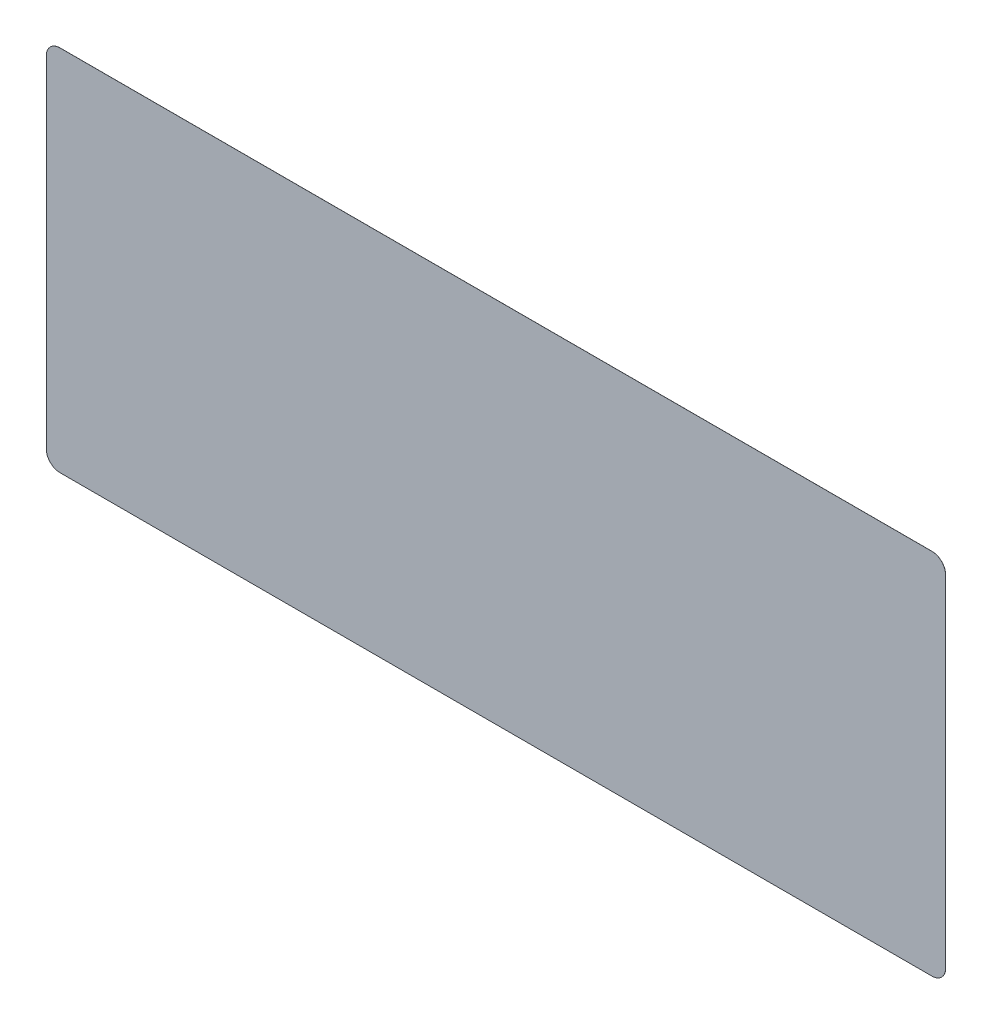
ISO-10303-21;
HEADER;
FILE_DESCRIPTION(('STEP AP214'),'2;1');
FILE_NAME('part.step','',(''),(''),'','','');
FILE_SCHEMA(('AUTOMOTIVE_DESIGN { 1 0 10303 214 1 1 1 1 }'));
ENDSEC;
DATA;
#1=APPLICATION_CONTEXT('core data for automotive mechanical design processes');
#2=APPLICATION_PROTOCOL_DEFINITION('international standard','automotive_design',2000,#1);
#3=PRODUCT_CONTEXT('',#1,'mechanical');
#4=PRODUCT('Part','Part','',(#3));
#5=PRODUCT_RELATED_PRODUCT_CATEGORY('part','',(#4));
#6=PRODUCT_DEFINITION_FORMATION('','',#4);
#7=PRODUCT_DEFINITION_CONTEXT('part definition',#1,'design');
#8=PRODUCT_DEFINITION('design','',#6,#7);
#9=PRODUCT_DEFINITION_SHAPE('','',#8);
#10=(LENGTH_UNIT() NAMED_UNIT(*) SI_UNIT(.MILLI.,.METRE.));
#11=(NAMED_UNIT(*) PLANE_ANGLE_UNIT() SI_UNIT($,.RADIAN.));
#12=(NAMED_UNIT(*) SI_UNIT($,.STERADIAN.) SOLID_ANGLE_UNIT());
#13=UNCERTAINTY_MEASURE_WITH_UNIT(LENGTH_MEASURE(1.E-05),#10,'distance_accuracy_value','');
#14=(GEOMETRIC_REPRESENTATION_CONTEXT(3) GLOBAL_UNCERTAINTY_ASSIGNED_CONTEXT((#13)) GLOBAL_UNIT_ASSIGNED_CONTEXT((#10,
#11,#12)) REPRESENTATION_CONTEXT('',''));
#15=CARTESIAN_POINT('',(0.,0.,0.));
#16=DIRECTION('',(0.,0.,1.));
#17=DIRECTION('',(1.,0.,0.));
#18=AXIS2_PLACEMENT_3D('',#15,#16,#17);
#19=CARTESIAN_POINT('',(78.,85.,0.01));
#20=DIRECTION('',(0.,0.,-1.));
#21=DIRECTION('',(-1.,0.,0.));
#22=AXIS2_PLACEMENT_3D('',#19,#20,#21);
#23=CYLINDRICAL_SURFACE('',#22,2.);
#24=CARTESIAN_POINT('',(78.,85.,0.));
#25=DIRECTION('',(0.,0.,1.));
#26=DIRECTION('',(1.,0.,0.));
#27=AXIS2_PLACEMENT_3D('',#24,#25,#26);
#28=CIRCLE('',#27,2.);
#29=CARTESIAN_POINT('',(76.,85.,0.));
#30=VERTEX_POINT('',#29);
#31=CARTESIAN_POINT('',(78.,83.,0.));
#32=VERTEX_POINT('',#31);
#33=EDGE_CURVE('E142',#30,#32,#28,.T.);
#34=ORIENTED_EDGE('',*,*,#33,.T.);
#35=DIRECTION('',(0.,0.,-1.));
#36=VECTOR('',#35,1.);
#37=CARTESIAN_POINT('',(78.,83.,0.01));
#38=LINE('',#37,#36);
#39=CARTESIAN_POINT('',(78.,83.,0.01));
#40=VERTEX_POINT('',#39);
#41=EDGE_CURVE('E11',#40,#32,#38,.T.);
#42=ORIENTED_EDGE('',*,*,#41,.F.);
#43=CARTESIAN_POINT('',(78.,85.,0.01));
#44=DIRECTION('',(0.,0.,1.));
#45=DIRECTION('',(1.,0.,0.));
#46=AXIS2_PLACEMENT_3D('',#43,#44,#45);
#47=CIRCLE('',#46,2.);
#48=CARTESIAN_POINT('',(76.,85.,0.01));
#49=VERTEX_POINT('',#48);
#50=EDGE_CURVE('E164',#49,#40,#47,.T.);
#51=ORIENTED_EDGE('',*,*,#50,.F.);
#52=DIRECTION('',(0.,0.,-1.));
#53=VECTOR('',#52,1.);
#54=CARTESIAN_POINT('',(76.,85.,0.01));
#55=LINE('',#54,#53);
#56=EDGE_CURVE('E138',#49,#30,#55,.T.);
#57=ORIENTED_EDGE('',*,*,#56,.T.);
#58=EDGE_LOOP('',(#34,#42,#51,#57));
#59=FACE_BOUND('',#58,.T.);
#60=ADVANCED_FACE('F41',(#59),#23,.T.);
#61=CARTESIAN_POINT('',(78.,83.,0.01));
#62=DIRECTION('',(0.,1.,0.));
#63=DIRECTION('',(0.,0.,1.));
#64=AXIS2_PLACEMENT_3D('',#61,#62,#63);
#65=PLANE('',#64);
#66=DIRECTION('',(1.,0.,0.));
#67=VECTOR('',#66,1.);
#68=CARTESIAN_POINT('',(78.,83.,0.));
#69=LINE('',#68,#67);
#70=CARTESIAN_POINT('',(206.,83.,0.));
#71=VERTEX_POINT('',#70);
#72=EDGE_CURVE('E146',#32,#71,#69,.T.);
#73=ORIENTED_EDGE('',*,*,#72,.T.);
#74=DIRECTION('',(0.,0.,-1.));
#75=VECTOR('',#74,1.);
#76=CARTESIAN_POINT('',(206.,83.,0.01));
#77=LINE('',#76,#75);
#78=CARTESIAN_POINT('',(206.,83.,0.01));
#79=VERTEX_POINT('',#78);
#80=EDGE_CURVE('E50',#79,#71,#77,.T.);
#81=ORIENTED_EDGE('',*,*,#80,.F.);
#82=DIRECTION('',(1.,0.,0.));
#83=VECTOR('',#82,1.);
#84=CARTESIAN_POINT('',(78.,83.,0.01));
#85=LINE('',#84,#83);
#86=EDGE_CURVE('E101',#40,#79,#85,.T.);
#87=ORIENTED_EDGE('',*,*,#86,.F.);
#88=ORIENTED_EDGE('',*,*,#41,.T.);
#89=EDGE_LOOP('',(#73,#81,#87,#88));
#90=FACE_BOUND('',#89,.T.);
#91=ADVANCED_FACE('F210',(#90),#65,.F.);
#92=CARTESIAN_POINT('',(206.,85.,0.01));
#93=DIRECTION('',(0.,0.,-1.));
#94=DIRECTION('',(-1.,0.,0.));
#95=AXIS2_PLACEMENT_3D('',#92,#93,#94);
#96=CYLINDRICAL_SURFACE('',#95,2.);
#97=CARTESIAN_POINT('',(206.,85.,0.));
#98=DIRECTION('',(0.,0.,1.));
#99=DIRECTION('',(1.,0.,0.));
#100=AXIS2_PLACEMENT_3D('',#97,#98,#99);
#101=CIRCLE('',#100,2.);
#102=CARTESIAN_POINT('',(208.,85.,0.));
#103=VERTEX_POINT('',#102);
#104=EDGE_CURVE('E149',#71,#103,#101,.T.);
#105=ORIENTED_EDGE('',*,*,#104,.T.);
#106=DIRECTION('',(0.,0.,-1.));
#107=VECTOR('',#106,1.);
#108=CARTESIAN_POINT('',(208.,85.,0.01));
#109=LINE('',#108,#107);
#110=CARTESIAN_POINT('',(208.,85.,0.01));
#111=VERTEX_POINT('',#110);
#112=EDGE_CURVE('E175',#111,#103,#109,.T.);
#113=ORIENTED_EDGE('',*,*,#112,.F.);
#114=CARTESIAN_POINT('',(206.,85.,0.01));
#115=DIRECTION('',(0.,0.,1.));
#116=DIRECTION('',(1.,0.,0.));
#117=AXIS2_PLACEMENT_3D('',#114,#115,#116);
#118=CIRCLE('',#117,2.);
#119=EDGE_CURVE('E185',#79,#111,#118,.T.);
#120=ORIENTED_EDGE('',*,*,#119,.F.);
#121=ORIENTED_EDGE('',*,*,#80,.T.);
#122=EDGE_LOOP('',(#105,#113,#120,#121));
#123=FACE_BOUND('',#122,.T.);
#124=ADVANCED_FACE('F183',(#123),#96,.T.);
#125=CARTESIAN_POINT('',(208.,135.,0.01));
#126=DIRECTION('',(-1.,0.,0.));
#127=DIRECTION('',(0.,0.,1.));
#128=AXIS2_PLACEMENT_3D('',#125,#126,#127);
#129=PLANE('',#128);
#130=DIRECTION('',(0.,1.,0.));
#131=VECTOR('',#130,1.);
#132=CARTESIAN_POINT('',(208.,135.,0.));
#133=LINE('',#132,#131);
#134=CARTESIAN_POINT('',(208.,135.,0.));
#135=VERTEX_POINT('',#134);
#136=EDGE_CURVE('E152',#103,#135,#133,.T.);
#137=ORIENTED_EDGE('',*,*,#136,.T.);
#138=DIRECTION('',(0.,0.,-1.));
#139=VECTOR('',#138,1.);
#140=CARTESIAN_POINT('',(208.,135.,0.01));
#141=LINE('',#140,#139);
#142=CARTESIAN_POINT('',(208.,135.,0.01));
#143=VERTEX_POINT('',#142);
#144=EDGE_CURVE('E171',#143,#135,#141,.T.);
#145=ORIENTED_EDGE('',*,*,#144,.F.);
#146=DIRECTION('',(0.,1.,0.));
#147=VECTOR('',#146,1.);
#148=CARTESIAN_POINT('',(208.,135.,0.01));
#149=LINE('',#148,#147);
#150=EDGE_CURVE('E198',#111,#143,#149,.T.);
#151=ORIENTED_EDGE('',*,*,#150,.F.);
#152=ORIENTED_EDGE('',*,*,#112,.T.);
#153=EDGE_LOOP('',(#137,#145,#151,#152));
#154=FACE_BOUND('',#153,.T.);
#155=ADVANCED_FACE('F193',(#154),#129,.F.);
#156=CARTESIAN_POINT('',(206.,135.,0.01));
#157=DIRECTION('',(0.,0.,-1.));
#158=DIRECTION('',(-1.,0.,0.));
#159=AXIS2_PLACEMENT_3D('',#156,#157,#158);
#160=CYLINDRICAL_SURFACE('',#159,2.);
#161=CARTESIAN_POINT('',(206.,135.,0.));
#162=DIRECTION('',(0.,0.,1.));
#163=DIRECTION('',(-1.,0.,0.));
#164=AXIS2_PLACEMENT_3D('',#161,#162,#163);
#165=CIRCLE('',#164,2.);
#166=CARTESIAN_POINT('',(206.,137.,0.));
#167=VERTEX_POINT('',#166);
#168=EDGE_CURVE('E155',#135,#167,#165,.T.);
#169=ORIENTED_EDGE('',*,*,#168,.T.);
#170=DIRECTION('',(0.,0.,-1.));
#171=VECTOR('',#170,1.);
#172=CARTESIAN_POINT('',(206.,137.,0.01));
#173=LINE('',#172,#171);
#174=CARTESIAN_POINT('',(206.,137.,0.01));
#175=VERTEX_POINT('',#174);
#176=EDGE_CURVE('E131',#175,#167,#173,.T.);
#177=ORIENTED_EDGE('',*,*,#176,.F.);
#178=CARTESIAN_POINT('',(206.,135.,0.01));
#179=DIRECTION('',(0.,0.,1.));
#180=DIRECTION('',(-1.,0.,0.));
#181=AXIS2_PLACEMENT_3D('',#178,#179,#180);
#182=CIRCLE('',#181,2.);
#183=EDGE_CURVE('E120',#143,#175,#182,.T.);
#184=ORIENTED_EDGE('',*,*,#183,.F.);
#185=ORIENTED_EDGE('',*,*,#144,.T.);
#186=EDGE_LOOP('',(#169,#177,#184,#185));
#187=FACE_BOUND('',#186,.T.);
#188=ADVANCED_FACE('F196',(#187),#160,.T.);
#189=CARTESIAN_POINT('',(78.,137.,0.01));
#190=DIRECTION('',(0.,-1.,0.));
#191=DIRECTION('',(0.,0.,-1.));
#192=AXIS2_PLACEMENT_3D('',#189,#190,#191);
#193=PLANE('',#192);
#194=DIRECTION('',(-1.,0.,0.));
#195=VECTOR('',#194,1.);
#196=CARTESIAN_POINT('',(78.,137.,0.));
#197=LINE('',#196,#195);
#198=CARTESIAN_POINT('',(78.,137.,0.));
#199=VERTEX_POINT('',#198);
#200=EDGE_CURVE('E129',#167,#199,#197,.T.);
#201=ORIENTED_EDGE('',*,*,#200,.T.);
#202=DIRECTION('',(0.,0.,-1.));
#203=VECTOR('',#202,1.);
#204=CARTESIAN_POINT('',(78.,137.,0.01));
#205=LINE('',#204,#203);
#206=CARTESIAN_POINT('',(78.,137.,0.01));
#207=VERTEX_POINT('',#206);
#208=EDGE_CURVE('E126',#207,#199,#205,.T.);
#209=ORIENTED_EDGE('',*,*,#208,.F.);
#210=DIRECTION('',(-1.,0.,0.));
#211=VECTOR('',#210,1.);
#212=CARTESIAN_POINT('',(78.,137.,0.01));
#213=LINE('',#212,#211);
#214=EDGE_CURVE('E114',#175,#207,#213,.T.);
#215=ORIENTED_EDGE('',*,*,#214,.F.);
#216=ORIENTED_EDGE('',*,*,#176,.T.);
#217=EDGE_LOOP('',(#201,#209,#215,#216));
#218=FACE_BOUND('',#217,.T.);
#219=ADVANCED_FACE('F127',(#218),#193,.F.);
#220=CARTESIAN_POINT('',(78.,135.,0.01));
#221=DIRECTION('',(0.,0.,-1.));
#222=DIRECTION('',(-1.,0.,0.));
#223=AXIS2_PLACEMENT_3D('',#220,#221,#222);
#224=CYLINDRICAL_SURFACE('',#223,2.);
#225=CARTESIAN_POINT('',(78.,135.,0.));
#226=DIRECTION('',(0.,0.,1.));
#227=DIRECTION('',(1.,0.,0.));
#228=AXIS2_PLACEMENT_3D('',#225,#226,#227);
#229=CIRCLE('',#228,2.);
#230=CARTESIAN_POINT('',(76.,135.,0.));
#231=VERTEX_POINT('',#230);
#232=EDGE_CURVE('E87',#199,#231,#229,.T.);
#233=ORIENTED_EDGE('',*,*,#232,.T.);
#234=DIRECTION('',(0.,0.,-1.));
#235=VECTOR('',#234,1.);
#236=CARTESIAN_POINT('',(76.,135.,0.01));
#237=LINE('',#236,#235);
#238=CARTESIAN_POINT('',(76.,135.,0.01));
#239=VERTEX_POINT('',#238);
#240=EDGE_CURVE('E132',#239,#231,#237,.T.);
#241=ORIENTED_EDGE('',*,*,#240,.F.);
#242=CARTESIAN_POINT('',(78.,135.,0.01));
#243=DIRECTION('',(0.,0.,1.));
#244=DIRECTION('',(1.,0.,0.));
#245=AXIS2_PLACEMENT_3D('',#242,#243,#244);
#246=CIRCLE('',#245,2.);
#247=EDGE_CURVE('E118',#207,#239,#246,.T.);
#248=ORIENTED_EDGE('',*,*,#247,.F.);
#249=ORIENTED_EDGE('',*,*,#208,.T.);
#250=EDGE_LOOP('',(#233,#241,#248,#249));
#251=FACE_BOUND('',#250,.T.);
#252=ADVANCED_FACE('F134',(#251),#224,.T.);
#253=CARTESIAN_POINT('',(76.,135.,0.01));
#254=DIRECTION('',(1.,0.,0.));
#255=DIRECTION('',(0.,0.,-1.));
#256=AXIS2_PLACEMENT_3D('',#253,#254,#255);
#257=PLANE('',#256);
#258=DIRECTION('',(0.,-1.,0.));
#259=VECTOR('',#258,1.);
#260=CARTESIAN_POINT('',(76.,135.,0.));
#261=LINE('',#260,#259);
#262=EDGE_CURVE('E93',#231,#30,#261,.T.);
#263=ORIENTED_EDGE('',*,*,#262,.T.);
#264=ORIENTED_EDGE('',*,*,#56,.F.);
#265=DIRECTION('',(0.,-1.,0.));
#266=VECTOR('',#265,1.);
#267=CARTESIAN_POINT('',(76.,135.,0.01));
#268=LINE('',#267,#266);
#269=EDGE_CURVE('E58',#239,#49,#268,.T.);
#270=ORIENTED_EDGE('',*,*,#269,.F.);
#271=ORIENTED_EDGE('',*,*,#240,.T.);
#272=EDGE_LOOP('',(#263,#264,#270,#271));
#273=FACE_BOUND('',#272,.T.);
#274=ADVANCED_FACE('F226',(#273),#257,.F.);
#275=CARTESIAN_POINT('',(78.,85.,0.01));
#276=DIRECTION('',(0.,0.,1.));
#277=DIRECTION('',(1.,0.,0.));
#278=AXIS2_PLACEMENT_3D('',#275,#276,#277);
#279=PLANE('',#278);
#280=ORIENTED_EDGE('',*,*,#50,.T.);
#281=ORIENTED_EDGE('',*,*,#86,.T.);
#282=ORIENTED_EDGE('',*,*,#119,.T.);
#283=ORIENTED_EDGE('',*,*,#150,.T.);
#284=ORIENTED_EDGE('',*,*,#183,.T.);
#285=ORIENTED_EDGE('',*,*,#214,.T.);
#286=ORIENTED_EDGE('',*,*,#247,.T.);
#287=ORIENTED_EDGE('',*,*,#269,.T.);
#288=EDGE_LOOP('',(#280,#281,#282,#283,#284,#285,#286,#287));
#289=FACE_BOUND('',#288,.T.);
#290=ADVANCED_FACE('F116',(#289),#279,.T.);
#291=CARTESIAN_POINT('',(78.,85.,0.));
#292=DIRECTION('',(0.,0.,1.));
#293=DIRECTION('',(1.,0.,0.));
#294=AXIS2_PLACEMENT_3D('',#291,#292,#293);
#295=PLANE('',#294);
#296=ORIENTED_EDGE('',*,*,#33,.F.);
#297=ORIENTED_EDGE('',*,*,#262,.F.);
#298=ORIENTED_EDGE('',*,*,#232,.F.);
#299=ORIENTED_EDGE('',*,*,#200,.F.);
#300=ORIENTED_EDGE('',*,*,#168,.F.);
#301=ORIENTED_EDGE('',*,*,#136,.F.);
#302=ORIENTED_EDGE('',*,*,#104,.F.);
#303=ORIENTED_EDGE('',*,*,#72,.F.);
#304=EDGE_LOOP('',(#296,#297,#298,#299,#300,#301,#302,#303));
#305=FACE_BOUND('',#304,.T.);
#306=ADVANCED_FACE('F189',(#305),#295,.F.);
#307=CLOSED_SHELL('',(#60,#91,#124,#155,#188,#219,#252,#274,#290,#306));
#308=MANIFOLD_SOLID_BREP('B2',#307);
#309=ADVANCED_BREP_SHAPE_REPRESENTATION('',(#18,#308),#14);
#310=SHAPE_DEFINITION_REPRESENTATION(#9,#309);
ENDSEC;
END-ISO-10303-21;
